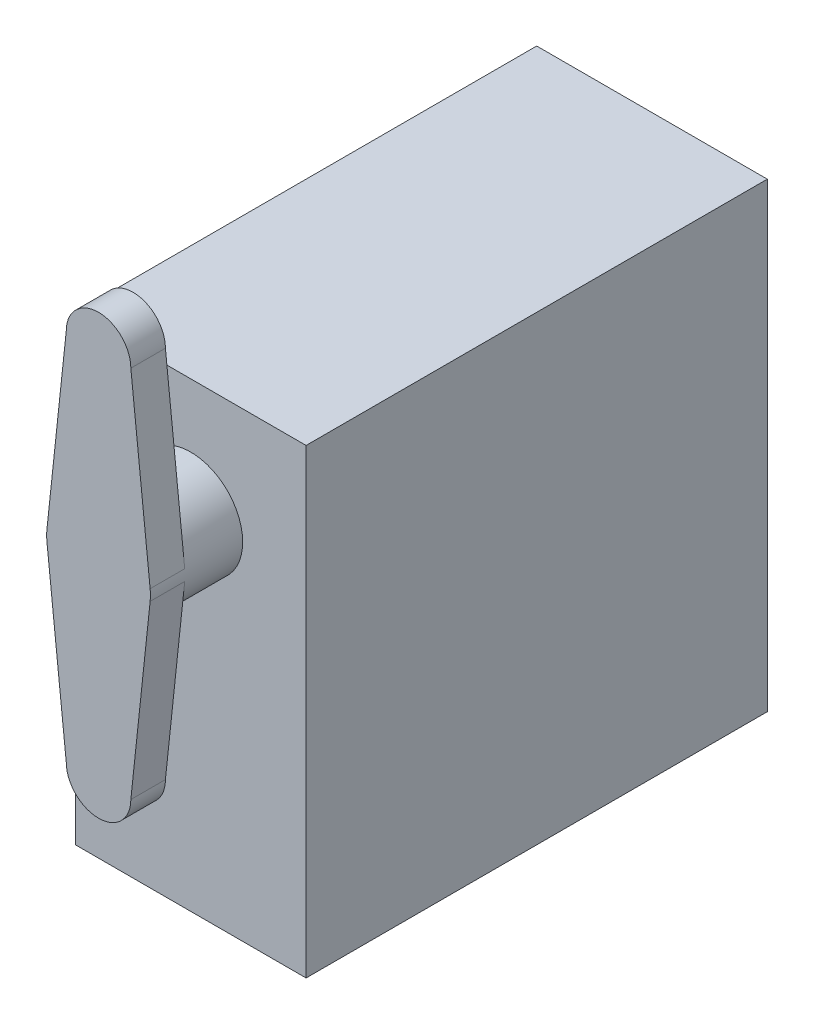
ISO-10303-21;
HEADER;
FILE_DESCRIPTION(('STEP AP214'),'2;1');
FILE_NAME('part.step','',(''),(''),'','','');
FILE_SCHEMA(('AUTOMOTIVE_DESIGN { 1 0 10303 214 1 1 1 1 }'));
ENDSEC;
DATA;
#1=APPLICATION_CONTEXT('core data for automotive mechanical design processes');
#2=APPLICATION_PROTOCOL_DEFINITION('international standard','automotive_design',2000,#1);
#3=PRODUCT_CONTEXT('',#1,'mechanical');
#4=PRODUCT('Part','Part','',(#3));
#5=PRODUCT_RELATED_PRODUCT_CATEGORY('part','',(#4));
#6=PRODUCT_DEFINITION_FORMATION('','',#4);
#7=PRODUCT_DEFINITION_CONTEXT('part definition',#1,'design');
#8=PRODUCT_DEFINITION('design','',#6,#7);
#9=PRODUCT_DEFINITION_SHAPE('','',#8);
#10=(LENGTH_UNIT() NAMED_UNIT(*) SI_UNIT(.MILLI.,.METRE.));
#11=(NAMED_UNIT(*) PLANE_ANGLE_UNIT() SI_UNIT($,.RADIAN.));
#12=(NAMED_UNIT(*) SI_UNIT($,.STERADIAN.) SOLID_ANGLE_UNIT());
#13=UNCERTAINTY_MEASURE_WITH_UNIT(LENGTH_MEASURE(1.E-05),#10,'distance_accuracy_value','');
#14=(GEOMETRIC_REPRESENTATION_CONTEXT(3) GLOBAL_UNCERTAINTY_ASSIGNED_CONTEXT((#13)) GLOBAL_UNIT_ASSIGNED_CONTEXT((#10,
#11,#12)) REPRESENTATION_CONTEXT('',''));
#15=CARTESIAN_POINT('',(0.,0.,0.));
#16=DIRECTION('',(0.,0.,1.));
#17=DIRECTION('',(1.,0.,0.));
#18=AXIS2_PLACEMENT_3D('',#15,#16,#17);
#19=CARTESIAN_POINT('',(9.99999999999999,20.,40.));
#20=DIRECTION('',(-1.,0.,0.));
#21=DIRECTION('',(0.,-1.,0.));
#22=AXIS2_PLACEMENT_3D('',#19,#20,#21);
#23=PLANE('',#22);
#24=DIRECTION('',(0.,1.,0.));
#25=VECTOR('',#24,1.);
#26=CARTESIAN_POINT('',(9.99999999999999,20.,0.));
#27=LINE('',#26,#25);
#28=CARTESIAN_POINT('',(10.,-20.,0.));
#29=VERTEX_POINT('',#28);
#30=CARTESIAN_POINT('',(9.99999999999999,20.,0.));
#31=VERTEX_POINT('',#30);
#32=EDGE_CURVE('E156',#29,#31,#27,.T.);
#33=ORIENTED_EDGE('',*,*,#32,.T.);
#34=DIRECTION('',(0.,0.,-1.));
#35=VECTOR('',#34,1.);
#36=CARTESIAN_POINT('',(9.99999999999999,20.,40.));
#37=LINE('',#36,#35);
#38=CARTESIAN_POINT('',(9.99999999999999,20.,40.));
#39=VERTEX_POINT('',#38);
#40=EDGE_CURVE('E11',#39,#31,#37,.T.);
#41=ORIENTED_EDGE('',*,*,#40,.F.);
#42=DIRECTION('',(0.,1.,0.));
#43=VECTOR('',#42,1.);
#44=CARTESIAN_POINT('',(9.99999999999999,20.,40.));
#45=LINE('',#44,#43);
#46=CARTESIAN_POINT('',(10.,-20.,40.));
#47=VERTEX_POINT('',#46);
#48=EDGE_CURVE('E158',#47,#39,#45,.T.);
#49=ORIENTED_EDGE('',*,*,#48,.F.);
#50=DIRECTION('',(0.,0.,-1.));
#51=VECTOR('',#50,1.);
#52=CARTESIAN_POINT('',(10.,-20.,40.));
#53=LINE('',#52,#51);
#54=EDGE_CURVE('E168',#47,#29,#53,.T.);
#55=ORIENTED_EDGE('',*,*,#54,.T.);
#56=EDGE_LOOP('',(#33,#41,#49,#55));
#57=FACE_BOUND('',#56,.T.);
#58=ADVANCED_FACE('F35',(#57),#23,.F.);
#59=CARTESIAN_POINT('',(-10.,20.,40.));
#60=DIRECTION('',(0.,-1.,0.));
#61=DIRECTION('',(0.,0.,-1.));
#62=AXIS2_PLACEMENT_3D('',#59,#60,#61);
#63=PLANE('',#62);
#64=DIRECTION('',(-1.,0.,0.));
#65=VECTOR('',#64,1.);
#66=CARTESIAN_POINT('',(-10.,20.,0.));
#67=LINE('',#66,#65);
#68=CARTESIAN_POINT('',(-10.,20.,0.));
#69=VERTEX_POINT('',#68);
#70=EDGE_CURVE('E171',#31,#69,#67,.T.);
#71=ORIENTED_EDGE('',*,*,#70,.T.);
#72=DIRECTION('',(0.,0.,-1.));
#73=VECTOR('',#72,1.);
#74=CARTESIAN_POINT('',(-10.,20.,40.));
#75=LINE('',#74,#73);
#76=CARTESIAN_POINT('',(-10.,20.,40.));
#77=VERTEX_POINT('',#76);
#78=EDGE_CURVE('E42',#77,#69,#75,.T.);
#79=ORIENTED_EDGE('',*,*,#78,.F.);
#80=DIRECTION('',(-1.,0.,0.));
#81=VECTOR('',#80,1.);
#82=CARTESIAN_POINT('',(-10.,20.,40.));
#83=LINE('',#82,#81);
#84=EDGE_CURVE('E161',#39,#77,#83,.T.);
#85=ORIENTED_EDGE('',*,*,#84,.F.);
#86=ORIENTED_EDGE('',*,*,#40,.T.);
#87=EDGE_LOOP('',(#71,#79,#85,#86));
#88=FACE_BOUND('',#87,.T.);
#89=ADVANCED_FACE('F201',(#88),#63,.F.);
#90=CARTESIAN_POINT('',(-10.,20.,40.));
#91=DIRECTION('',(1.,0.,0.));
#92=DIRECTION('',(0.,1.,0.));
#93=AXIS2_PLACEMENT_3D('',#90,#91,#92);
#94=PLANE('',#93);
#95=DIRECTION('',(0.,-1.,0.));
#96=VECTOR('',#95,1.);
#97=CARTESIAN_POINT('',(-10.,20.,0.));
#98=LINE('',#97,#96);
#99=CARTESIAN_POINT('',(-10.,-20.,0.));
#100=VERTEX_POINT('',#99);
#101=EDGE_CURVE('E173',#69,#100,#98,.T.);
#102=ORIENTED_EDGE('',*,*,#101,.T.);
#103=DIRECTION('',(0.,0.,-1.));
#104=VECTOR('',#103,1.);
#105=CARTESIAN_POINT('',(-10.,-20.,40.));
#106=LINE('',#105,#104);
#107=CARTESIAN_POINT('',(-10.,-20.,40.));
#108=VERTEX_POINT('',#107);
#109=EDGE_CURVE('E178',#108,#100,#106,.T.);
#110=ORIENTED_EDGE('',*,*,#109,.F.);
#111=DIRECTION('',(0.,-1.,0.));
#112=VECTOR('',#111,1.);
#113=CARTESIAN_POINT('',(-10.,20.,40.));
#114=LINE('',#113,#112);
#115=EDGE_CURVE('E164',#77,#108,#114,.T.);
#116=ORIENTED_EDGE('',*,*,#115,.F.);
#117=ORIENTED_EDGE('',*,*,#78,.T.);
#118=EDGE_LOOP('',(#102,#110,#116,#117));
#119=FACE_BOUND('',#118,.T.);
#120=ADVANCED_FACE('F185',(#119),#94,.F.);
#121=CARTESIAN_POINT('',(-10.,-20.,40.));
#122=DIRECTION('',(0.,1.,0.));
#123=DIRECTION('',(0.,0.,1.));
#124=AXIS2_PLACEMENT_3D('',#121,#122,#123);
#125=PLANE('',#124);
#126=DIRECTION('',(1.,0.,0.));
#127=VECTOR('',#126,1.);
#128=CARTESIAN_POINT('',(-10.,-20.,0.));
#129=LINE('',#128,#127);
#130=EDGE_CURVE('E162',#100,#29,#129,.T.);
#131=ORIENTED_EDGE('',*,*,#130,.T.);
#132=ORIENTED_EDGE('',*,*,#54,.F.);
#133=DIRECTION('',(1.,0.,0.));
#134=VECTOR('',#133,1.);
#135=CARTESIAN_POINT('',(-10.,-20.,40.));
#136=LINE('',#135,#134);
#137=EDGE_CURVE('E166',#108,#47,#136,.T.);
#138=ORIENTED_EDGE('',*,*,#137,.F.);
#139=ORIENTED_EDGE('',*,*,#109,.T.);
#140=EDGE_LOOP('',(#131,#132,#138,#139));
#141=FACE_BOUND('',#140,.T.);
#142=ADVANCED_FACE('F194',(#141),#125,.F.);
#143=CARTESIAN_POINT('',(0.,0.,40.));
#144=DIRECTION('',(0.,0.,1.));
#145=DIRECTION('',(1.,0.,0.));
#146=AXIS2_PLACEMENT_3D('',#143,#144,#145);
#147=PLANE('',#146);
#148=CARTESIAN_POINT('',(0.,10.,40.));
#149=DIRECTION('',(0.,0.,1.));
#150=DIRECTION('',(1.,0.,0.));
#151=AXIS2_PLACEMENT_3D('',#148,#149,#150);
#152=CIRCLE('',#151,4.5);
#153=CARTESIAN_POINT('',(4.5,10.,40.));
#154=VERTEX_POINT('',#153);
#155=EDGE_CURVE('E147',#154,#154,#152,.T.);
#156=ORIENTED_EDGE('',*,*,#155,.F.);
#157=EDGE_LOOP('',(#156));
#158=FACE_BOUND('',#157,.T.);
#159=ORIENTED_EDGE('',*,*,#48,.T.);
#160=ORIENTED_EDGE('',*,*,#84,.T.);
#161=ORIENTED_EDGE('',*,*,#115,.T.);
#162=ORIENTED_EDGE('',*,*,#137,.T.);
#163=EDGE_LOOP('',(#159,#160,#161,#162));
#164=FACE_BOUND('',#163,.T.);
#165=ADVANCED_FACE('F200',(#158,#164),#147,.T.);
#166=CARTESIAN_POINT('',(0.,0.,0.));
#167=DIRECTION('',(0.,0.,1.));
#168=DIRECTION('',(1.,0.,0.));
#169=AXIS2_PLACEMENT_3D('',#166,#167,#168);
#170=PLANE('',#169);
#171=ORIENTED_EDGE('',*,*,#32,.F.);
#172=ORIENTED_EDGE('',*,*,#130,.F.);
#173=ORIENTED_EDGE('',*,*,#101,.F.);
#174=ORIENTED_EDGE('',*,*,#70,.F.);
#175=EDGE_LOOP('',(#171,#172,#173,#174));
#176=FACE_BOUND('',#175,.T.);
#177=ADVANCED_FACE('F191',(#176),#170,.F.);
#178=CARTESIAN_POINT('',(0.,10.,45.));
#179=DIRECTION('',(0.,0.,-1.));
#180=DIRECTION('',(-1.,0.,0.));
#181=AXIS2_PLACEMENT_3D('',#178,#179,#180);
#182=CYLINDRICAL_SURFACE('',#181,4.5);
#183=CARTESIAN_POINT('',(0.,10.,45.));
#184=DIRECTION('',(0.,0.,1.));
#185=DIRECTION('',(1.,0.,0.));
#186=AXIS2_PLACEMENT_3D('',#183,#184,#185);
#187=CIRCLE('',#186,4.5);
#188=CARTESIAN_POINT('',(4.47469055819578,10.4765966936452,45.));
#189=VERTEX_POINT('',#188);
#190=CARTESIAN_POINT('',(-4.47469055819578,10.4765966936452,45.));
#191=VERTEX_POINT('',#190);
#192=EDGE_CURVE('E155',#189,#191,#187,.T.);
#193=ORIENTED_EDGE('',*,*,#192,.F.);
#194=DIRECTION('',(0.,0.,-1.));
#195=VECTOR('',#194,1.);
#196=CARTESIAN_POINT('',(4.47469055819578,10.4765966936452,48.));
#197=LINE('',#196,#195);
#198=CARTESIAN_POINT('',(4.47469055819578,10.4765966936452,48.));
#199=VERTEX_POINT('',#198);
#200=EDGE_CURVE('E151',#199,#189,#197,.T.);
#201=ORIENTED_EDGE('',*,*,#200,.F.);
#202=CARTESIAN_POINT('',(0.,10.,48.));
#203=DIRECTION('',(0.,0.,1.));
#204=DIRECTION('',(1.,0.,0.));
#205=AXIS2_PLACEMENT_3D('',#202,#203,#204);
#206=CIRCLE('',#205,4.5);
#207=CARTESIAN_POINT('',(4.47469055819578,9.52340330635483,48.));
#208=VERTEX_POINT('',#207);
#209=EDGE_CURVE('E132',#208,#199,#206,.T.);
#210=ORIENTED_EDGE('',*,*,#209,.F.);
#211=DIRECTION('',(0.,0.,-1.));
#212=VECTOR('',#211,1.);
#213=CARTESIAN_POINT('',(4.47469055819578,9.52340330635483,48.));
#214=LINE('',#213,#212);
#215=CARTESIAN_POINT('',(4.47469055819578,9.52340330635483,45.));
#216=VERTEX_POINT('',#215);
#217=EDGE_CURVE('E129',#208,#216,#214,.T.);
#218=ORIENTED_EDGE('',*,*,#217,.T.);
#219=CARTESIAN_POINT('',(-4.47469055819578,9.52340330635483,45.));
#220=VERTEX_POINT('',#219);
#221=EDGE_CURVE('E49',#220,#216,#187,.T.);
#222=ORIENTED_EDGE('',*,*,#221,.F.);
#223=DIRECTION('',(0.,0.,-1.));
#224=VECTOR('',#223,1.);
#225=CARTESIAN_POINT('',(-4.47469055819578,9.52340330635483,48.));
#226=LINE('',#225,#224);
#227=CARTESIAN_POINT('',(-4.47469055819578,9.52340330635483,48.));
#228=VERTEX_POINT('',#227);
#229=EDGE_CURVE('E366',#228,#220,#226,.T.);
#230=ORIENTED_EDGE('',*,*,#229,.F.);
#231=CARTESIAN_POINT('',(0.,10.,48.));
#232=DIRECTION('',(0.,0.,1.));
#233=DIRECTION('',(1.,0.,0.));
#234=AXIS2_PLACEMENT_3D('',#231,#232,#233);
#235=CIRCLE('',#234,4.5);
#236=CARTESIAN_POINT('',(-4.47469055819578,10.4765966936452,48.));
#237=VERTEX_POINT('',#236);
#238=EDGE_CURVE('E381',#237,#228,#235,.T.);
#239=ORIENTED_EDGE('',*,*,#238,.F.);
#240=DIRECTION('',(0.,0.,-1.));
#241=VECTOR('',#240,1.);
#242=CARTESIAN_POINT('',(-4.47469055819578,10.4765966936452,48.));
#243=LINE('',#242,#241);
#244=EDGE_CURVE('E368',#237,#191,#243,.T.);
#245=ORIENTED_EDGE('',*,*,#244,.T.);
#246=EDGE_LOOP('',(#193,#201,#210,#218,#222,#230,#239,#245));
#247=FACE_BOUND('',#246,.T.);
#248=ORIENTED_EDGE('',*,*,#155,.T.);
#249=EDGE_LOOP('',(#248));
#250=FACE_BOUND('',#249,.T.);
#251=ADVANCED_FACE('F213',(#247,#250),#182,.T.);
#252=CARTESIAN_POINT('',(0.,-6.2,45.));
#253=DIRECTION('',(0.,0.,-1.));
#254=DIRECTION('',(-1.,0.,0.));
#255=AXIS2_PLACEMENT_3D('',#252,#253,#254);
#256=PLANE('',#255);
#257=DIRECTION('',(-0.105910376365594,0.994375679599063,0.));
#258=VECTOR('',#257,1.);
#259=CARTESIAN_POINT('',(4.47469055819578,10.4765966936452,45.));
#260=LINE('',#259,#258);
#261=CARTESIAN_POINT('',(2.8,26.2,45.));
#262=VERTEX_POINT('',#261);
#263=EDGE_CURVE('E348',#189,#262,#260,.T.);
#264=ORIENTED_EDGE('',*,*,#263,.F.);
#265=ORIENTED_EDGE('',*,*,#192,.T.);
#266=DIRECTION('',(-0.105910376365594,-0.994375679599063,0.));
#267=VECTOR('',#266,1.);
#268=CARTESIAN_POINT('',(-4.47469055819578,10.4765966936452,45.));
#269=LINE('',#268,#267);
#270=CARTESIAN_POINT('',(-2.8,26.2,45.));
#271=VERTEX_POINT('',#270);
#272=EDGE_CURVE('E357',#271,#191,#269,.T.);
#273=ORIENTED_EDGE('',*,*,#272,.F.);
#274=CARTESIAN_POINT('',(0.,26.2,45.));
#275=DIRECTION('',(0.,0.,1.));
#276=DIRECTION('',(1.,0.,0.));
#277=AXIS2_PLACEMENT_3D('',#274,#275,#276);
#278=CIRCLE('',#277,2.8);
#279=EDGE_CURVE('E351',#262,#271,#278,.T.);
#280=ORIENTED_EDGE('',*,*,#279,.F.);
#281=EDGE_LOOP('',(#264,#265,#273,#280));
#282=FACE_BOUND('',#281,.T.);
#283=ADVANCED_FACE('F219',(#282),#256,.T.);
#284=CARTESIAN_POINT('',(0.,-6.2,48.));
#285=DIRECTION('',(0.,0.,-1.));
#286=DIRECTION('',(-1.,0.,0.));
#287=AXIS2_PLACEMENT_3D('',#284,#285,#286);
#288=CYLINDRICAL_SURFACE('',#287,2.8);
#289=CARTESIAN_POINT('',(0.,-6.2,45.));
#290=DIRECTION('',(0.,0.,1.));
#291=DIRECTION('',(-1.,0.,0.));
#292=AXIS2_PLACEMENT_3D('',#289,#290,#291);
#293=CIRCLE('',#292,2.8);
#294=CARTESIAN_POINT('',(-2.8,-6.2,45.));
#295=VERTEX_POINT('',#294);
#296=CARTESIAN_POINT('',(2.8,-6.2,45.));
#297=VERTEX_POINT('',#296);
#298=EDGE_CURVE('E146',#295,#297,#293,.T.);
#299=ORIENTED_EDGE('',*,*,#298,.T.);
#300=DIRECTION('',(0.,0.,-1.));
#301=VECTOR('',#300,1.);
#302=CARTESIAN_POINT('',(2.8,-6.2,48.));
#303=LINE('',#302,#301);
#304=CARTESIAN_POINT('',(2.8,-6.2,48.));
#305=VERTEX_POINT('',#304);
#306=EDGE_CURVE('E127',#305,#297,#303,.T.);
#307=ORIENTED_EDGE('',*,*,#306,.F.);
#308=CARTESIAN_POINT('',(0.,-6.2,48.));
#309=DIRECTION('',(0.,0.,1.));
#310=DIRECTION('',(-1.,0.,0.));
#311=AXIS2_PLACEMENT_3D('',#308,#309,#310);
#312=CIRCLE('',#311,2.8);
#313=CARTESIAN_POINT('',(-2.8,-6.2,48.));
#314=VERTEX_POINT('',#313);
#315=EDGE_CURVE('E133',#314,#305,#312,.T.);
#316=ORIENTED_EDGE('',*,*,#315,.F.);
#317=DIRECTION('',(0.,0.,-1.));
#318=VECTOR('',#317,1.);
#319=CARTESIAN_POINT('',(-2.8,-6.2,48.));
#320=LINE('',#319,#318);
#321=EDGE_CURVE('E364',#314,#295,#320,.T.);
#322=ORIENTED_EDGE('',*,*,#321,.T.);
#323=EDGE_LOOP('',(#299,#307,#316,#322));
#324=FACE_BOUND('',#323,.T.);
#325=ADVANCED_FACE('F144',(#324),#288,.T.);
#326=CARTESIAN_POINT('',(4.47469055819578,9.52340330635483,48.));
#327=DIRECTION('',(-0.994375679599063,0.105910376365594,0.));
#328=DIRECTION('',(-0.105910376365594,-0.994375679599063,0.));
#329=AXIS2_PLACEMENT_3D('',#326,#327,#328);
#330=PLANE('',#329);
#331=DIRECTION('',(0.105910376365594,0.994375679599063,0.));
#332=VECTOR('',#331,1.);
#333=CARTESIAN_POINT('',(4.47469055819578,9.52340330635483,45.));
#334=LINE('',#333,#332);
#335=EDGE_CURVE('E355',#297,#216,#334,.T.);
#336=ORIENTED_EDGE('',*,*,#335,.T.);
#337=ORIENTED_EDGE('',*,*,#217,.F.);
#338=DIRECTION('',(0.105910376365594,0.994375679599063,0.));
#339=VECTOR('',#338,1.);
#340=CARTESIAN_POINT('',(4.47469055819578,9.52340330635483,48.));
#341=LINE('',#340,#339);
#342=EDGE_CURVE('E123',#305,#208,#341,.T.);
#343=ORIENTED_EDGE('',*,*,#342,.F.);
#344=ORIENTED_EDGE('',*,*,#306,.T.);
#345=EDGE_LOOP('',(#336,#337,#343,#344));
#346=FACE_BOUND('',#345,.T.);
#347=ADVANCED_FACE('F125',(#346),#330,.F.);
#348=CARTESIAN_POINT('',(4.47469055819578,10.4765966936452,48.));
#349=DIRECTION('',(-0.994375679599063,-0.105910376365594,0.));
#350=DIRECTION('',(0.105910376365594,-0.994375679599063,0.));
#351=AXIS2_PLACEMENT_3D('',#348,#349,#350);
#352=PLANE('',#351);
#353=ORIENTED_EDGE('',*,*,#263,.T.);
#354=DIRECTION('',(0.,0.,-1.));
#355=VECTOR('',#354,1.);
#356=CARTESIAN_POINT('',(2.8,26.2,48.));
#357=LINE('',#356,#355);
#358=CARTESIAN_POINT('',(2.8,26.2,48.));
#359=VERTEX_POINT('',#358);
#360=EDGE_CURVE('E374',#359,#262,#357,.T.);
#361=ORIENTED_EDGE('',*,*,#360,.F.);
#362=DIRECTION('',(-0.105910376365594,0.994375679599063,0.));
#363=VECTOR('',#362,1.);
#364=CARTESIAN_POINT('',(4.47469055819578,10.4765966936452,48.));
#365=LINE('',#364,#363);
#366=EDGE_CURVE('E377',#199,#359,#365,.T.);
#367=ORIENTED_EDGE('',*,*,#366,.F.);
#368=ORIENTED_EDGE('',*,*,#200,.T.);
#369=EDGE_LOOP('',(#353,#361,#367,#368));
#370=FACE_BOUND('',#369,.T.);
#371=ADVANCED_FACE('F224',(#370),#352,.F.);
#372=CARTESIAN_POINT('',(0.,26.2,48.));
#373=DIRECTION('',(0.,0.,-1.));
#374=DIRECTION('',(-1.,0.,0.));
#375=AXIS2_PLACEMENT_3D('',#372,#373,#374);
#376=CYLINDRICAL_SURFACE('',#375,2.8);
#377=ORIENTED_EDGE('',*,*,#279,.T.);
#378=DIRECTION('',(0.,0.,-1.));
#379=VECTOR('',#378,1.);
#380=CARTESIAN_POINT('',(-2.8,26.2,48.));
#381=LINE('',#380,#379);
#382=CARTESIAN_POINT('',(-2.8,26.2,48.));
#383=VERTEX_POINT('',#382);
#384=EDGE_CURVE('E371',#383,#271,#381,.T.);
#385=ORIENTED_EDGE('',*,*,#384,.F.);
#386=CARTESIAN_POINT('',(0.,26.2,48.));
#387=DIRECTION('',(0.,0.,1.));
#388=DIRECTION('',(1.,0.,0.));
#389=AXIS2_PLACEMENT_3D('',#386,#387,#388);
#390=CIRCLE('',#389,2.8);
#391=EDGE_CURVE('E386',#359,#383,#390,.T.);
#392=ORIENTED_EDGE('',*,*,#391,.F.);
#393=ORIENTED_EDGE('',*,*,#360,.T.);
#394=EDGE_LOOP('',(#377,#385,#392,#393));
#395=FACE_BOUND('',#394,.T.);
#396=ADVANCED_FACE('F227',(#395),#376,.T.);
#397=CARTESIAN_POINT('',(-4.47469055819578,10.4765966936452,48.));
#398=DIRECTION('',(0.994375679599063,-0.105910376365594,0.));
#399=DIRECTION('',(0.105910376365594,0.994375679599063,0.));
#400=AXIS2_PLACEMENT_3D('',#397,#398,#399);
#401=PLANE('',#400);
#402=ORIENTED_EDGE('',*,*,#272,.T.);
#403=ORIENTED_EDGE('',*,*,#244,.F.);
#404=DIRECTION('',(-0.105910376365594,-0.994375679599063,0.));
#405=VECTOR('',#404,1.);
#406=CARTESIAN_POINT('',(-4.47469055819578,10.4765966936452,48.));
#407=LINE('',#406,#405);
#408=EDGE_CURVE('E383',#383,#237,#407,.T.);
#409=ORIENTED_EDGE('',*,*,#408,.F.);
#410=ORIENTED_EDGE('',*,*,#384,.T.);
#411=EDGE_LOOP('',(#402,#403,#409,#410));
#412=FACE_BOUND('',#411,.T.);
#413=ADVANCED_FACE('F231',(#412),#401,.F.);
#414=CARTESIAN_POINT('',(-4.47469055819578,9.52340330635483,48.));
#415=DIRECTION('',(0.994375679599063,0.105910376365594,0.));
#416=DIRECTION('',(-0.105910376365594,0.994375679599063,0.));
#417=AXIS2_PLACEMENT_3D('',#414,#415,#416);
#418=PLANE('',#417);
#419=DIRECTION('',(0.105910376365594,-0.994375679599063,0.));
#420=VECTOR('',#419,1.);
#421=CARTESIAN_POINT('',(-4.47469055819578,9.52340330635483,45.));
#422=LINE('',#421,#420);
#423=EDGE_CURVE('E142',#220,#295,#422,.T.);
#424=ORIENTED_EDGE('',*,*,#423,.T.);
#425=ORIENTED_EDGE('',*,*,#321,.F.);
#426=DIRECTION('',(0.105910376365594,-0.994375679599063,0.));
#427=VECTOR('',#426,1.);
#428=CARTESIAN_POINT('',(-4.47469055819578,9.52340330635483,48.));
#429=LINE('',#428,#427);
#430=EDGE_CURVE('E138',#228,#314,#429,.T.);
#431=ORIENTED_EDGE('',*,*,#430,.F.);
#432=ORIENTED_EDGE('',*,*,#229,.T.);
#433=EDGE_LOOP('',(#424,#425,#431,#432));
#434=FACE_BOUND('',#433,.T.);
#435=ADVANCED_FACE('F235',(#434),#418,.F.);
#436=CARTESIAN_POINT('',(0.,-6.2,48.));
#437=DIRECTION('',(0.,0.,-1.));
#438=DIRECTION('',(-1.,0.,0.));
#439=AXIS2_PLACEMENT_3D('',#436,#437,#438);
#440=PLANE('',#439);
#441=ORIENTED_EDGE('',*,*,#315,.T.);
#442=ORIENTED_EDGE('',*,*,#342,.T.);
#443=ORIENTED_EDGE('',*,*,#209,.T.);
#444=ORIENTED_EDGE('',*,*,#366,.T.);
#445=ORIENTED_EDGE('',*,*,#391,.T.);
#446=ORIENTED_EDGE('',*,*,#408,.T.);
#447=ORIENTED_EDGE('',*,*,#238,.T.);
#448=ORIENTED_EDGE('',*,*,#430,.T.);
#449=EDGE_LOOP('',(#441,#442,#443,#444,#445,#446,#447,#448));
#450=FACE_BOUND('',#449,.T.);
#451=ADVANCED_FACE('F136',(#450),#440,.F.);
#452=ORIENTED_EDGE('',*,*,#423,.F.);
#453=ORIENTED_EDGE('',*,*,#221,.T.);
#454=ORIENTED_EDGE('',*,*,#335,.F.);
#455=ORIENTED_EDGE('',*,*,#298,.F.);
#456=EDGE_LOOP('',(#452,#453,#454,#455));
#457=FACE_BOUND('',#456,.T.);
#458=ADVANCED_FACE('F240',(#457),#256,.T.);
#459=CLOSED_SHELL('',(#58,#89,#120,#142,#165,#177,#251,#283,#325,#347,#371,#396,#413,#435,#451,#458));
#460=MANIFOLD_SOLID_BREP('B2',#459);
#461=ADVANCED_BREP_SHAPE_REPRESENTATION('',(#18,#460),#14);
#462=SHAPE_DEFINITION_REPRESENTATION(#9,#461);
ENDSEC;
END-ISO-10303-21;
